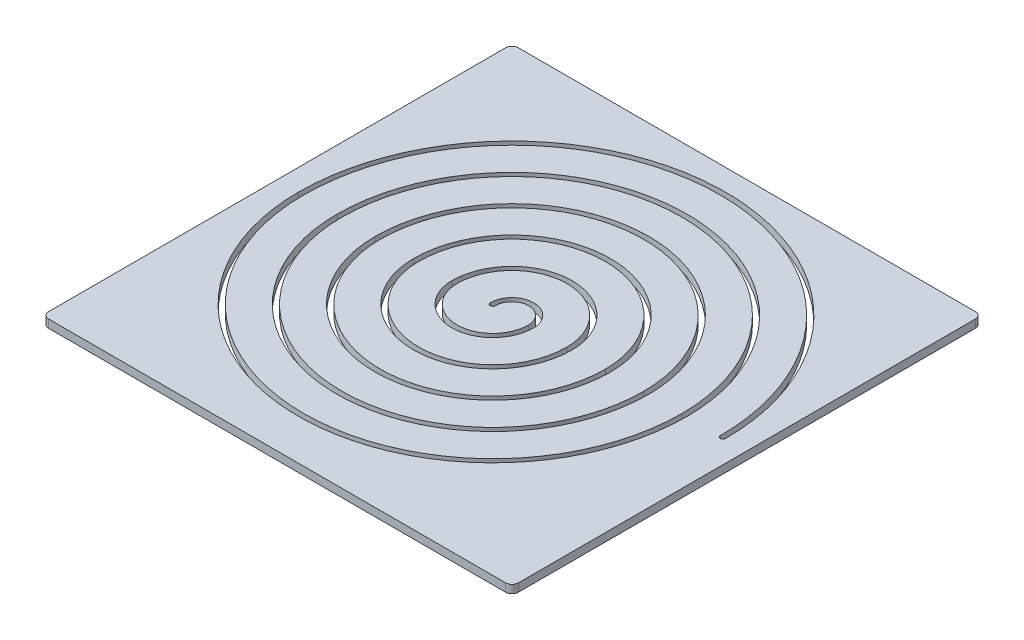
ISO-10303-21;
HEADER;
FILE_DESCRIPTION(('STEP AP214'),'2;1');
FILE_NAME('part.step','',(''),(''),'','','');
FILE_SCHEMA(('AUTOMOTIVE_DESIGN { 1 0 10303 214 1 1 1 1 }'));
ENDSEC;
DATA;
#1=APPLICATION_CONTEXT('core data for automotive mechanical design processes');
#2=APPLICATION_PROTOCOL_DEFINITION('international standard','automotive_design',2000,#1);
#3=PRODUCT_CONTEXT('',#1,'mechanical');
#4=PRODUCT('Part','Part','',(#3));
#5=PRODUCT_RELATED_PRODUCT_CATEGORY('part','',(#4));
#6=PRODUCT_DEFINITION_FORMATION('','',#4);
#7=PRODUCT_DEFINITION_CONTEXT('part definition',#1,'design');
#8=PRODUCT_DEFINITION('design','',#6,#7);
#9=PRODUCT_DEFINITION_SHAPE('','',#8);
#10=(LENGTH_UNIT() NAMED_UNIT(*) SI_UNIT(.MILLI.,.METRE.));
#11=(NAMED_UNIT(*) PLANE_ANGLE_UNIT() SI_UNIT($,.RADIAN.));
#12=(NAMED_UNIT(*) SI_UNIT($,.STERADIAN.) SOLID_ANGLE_UNIT());
#13=UNCERTAINTY_MEASURE_WITH_UNIT(LENGTH_MEASURE(1.E-05),#10,'distance_accuracy_value','');
#14=(GEOMETRIC_REPRESENTATION_CONTEXT(3) GLOBAL_UNCERTAINTY_ASSIGNED_CONTEXT((#13)) GLOBAL_UNIT_ASSIGNED_CONTEXT((#10,
#11,#12)) REPRESENTATION_CONTEXT('',''));
#15=CARTESIAN_POINT('',(0.,0.,0.));
#16=DIRECTION('',(0.,0.,1.));
#17=DIRECTION('',(1.,0.,0.));
#18=AXIS2_PLACEMENT_3D('',#15,#16,#17);
#19=CARTESIAN_POINT('',(-357.5,12.7,357.5));
#20=DIRECTION('',(0.,1.,0.));
#21=DIRECTION('',(0.,0.,1.));
#22=AXIS2_PLACEMENT_3D('',#19,#20,#21);
#23=PLANE('',#22);
#24=CARTESIAN_POINT('',(-357.5,12.7,357.5));
#25=DIRECTION('',(0.,1.,0.));
#26=DIRECTION('',(0.,0.,1.));
#27=AXIS2_PLACEMENT_3D('',#24,#25,#26);
#28=CIRCLE('',#27,9.99999999999998);
#29=CARTESIAN_POINT('',(-367.5,12.7,357.5));
#30=VERTEX_POINT('',#29);
#31=CARTESIAN_POINT('',(-357.5,12.7,367.5));
#32=VERTEX_POINT('',#31);
#33=EDGE_CURVE('E438',#30,#32,#28,.T.);
#34=ORIENTED_EDGE('',*,*,#33,.T.);
#35=DIRECTION('',(1.,0.,0.));
#36=VECTOR('',#35,1.);
#37=CARTESIAN_POINT('',(-357.5,12.7,367.5));
#38=LINE('',#37,#36);
#39=CARTESIAN_POINT('',(357.5,12.7,367.5));
#40=VERTEX_POINT('',#39);
#41=EDGE_CURVE('E441',#32,#40,#38,.T.);
#42=ORIENTED_EDGE('',*,*,#41,.T.);
#43=CARTESIAN_POINT('',(357.5,12.7,357.5));
#44=DIRECTION('',(0.,1.,0.));
#45=DIRECTION('',(0.,0.,1.));
#46=AXIS2_PLACEMENT_3D('',#43,#44,#45);
#47=CIRCLE('',#46,9.99999999999998);
#48=CARTESIAN_POINT('',(367.5,12.7,357.5));
#49=VERTEX_POINT('',#48);
#50=EDGE_CURVE('E444',#40,#49,#47,.T.);
#51=ORIENTED_EDGE('',*,*,#50,.T.);
#52=DIRECTION('',(0.,0.,-1.));
#53=VECTOR('',#52,1.);
#54=CARTESIAN_POINT('',(367.5,12.7,-357.5));
#55=LINE('',#54,#53);
#56=CARTESIAN_POINT('',(367.5,12.7,-357.5));
#57=VERTEX_POINT('',#56);
#58=EDGE_CURVE('E446',#49,#57,#55,.T.);
#59=ORIENTED_EDGE('',*,*,#58,.T.);
#60=CARTESIAN_POINT('',(357.5,12.7,-357.5));
#61=DIRECTION('',(0.,1.,0.));
#62=DIRECTION('',(0.,0.,-1.));
#63=AXIS2_PLACEMENT_3D('',#60,#61,#62);
#64=CIRCLE('',#63,9.99999999999998);
#65=CARTESIAN_POINT('',(357.5,12.7,-367.5));
#66=VERTEX_POINT('',#65);
#67=EDGE_CURVE('E448',#57,#66,#64,.T.);
#68=ORIENTED_EDGE('',*,*,#67,.T.);
#69=DIRECTION('',(-1.,0.,0.));
#70=VECTOR('',#69,1.);
#71=CARTESIAN_POINT('',(-357.5,12.7,-367.5));
#72=LINE('',#71,#70);
#73=CARTESIAN_POINT('',(-357.5,12.7,-367.5));
#74=VERTEX_POINT('',#73);
#75=EDGE_CURVE('E450',#66,#74,#72,.T.);
#76=ORIENTED_EDGE('',*,*,#75,.T.);
#77=CARTESIAN_POINT('',(-357.5,12.7,-357.5));
#78=DIRECTION('',(0.,1.,0.));
#79=DIRECTION('',(0.,0.,1.));
#80=AXIS2_PLACEMENT_3D('',#77,#78,#79);
#81=CIRCLE('',#80,9.99999999999998);
#82=CARTESIAN_POINT('',(-367.5,12.7,-357.5));
#83=VERTEX_POINT('',#82);
#84=EDGE_CURVE('E452',#74,#83,#81,.T.);
#85=ORIENTED_EDGE('',*,*,#84,.T.);
#86=DIRECTION('',(0.,0.,1.));
#87=VECTOR('',#86,1.);
#88=CARTESIAN_POINT('',(-367.5,12.7,-357.5));
#89=LINE('',#88,#87);
#90=EDGE_CURVE('E454',#83,#30,#89,.T.);
#91=ORIENTED_EDGE('',*,*,#90,.T.);
#92=EDGE_LOOP('',(#34,#42,#51,#59,#68,#76,#85,#91));
#93=FACE_BOUND('',#92,.T.);
#94=CARTESIAN_POINT('',(-30.,12.7,0.));
#95=DIRECTION('',(0.,-1.,0.));
#96=DIRECTION('',(0.,0.,-1.));
#97=AXIS2_PLACEMENT_3D('',#94,#95,#96);
#98=CIRCLE('',#97,56.);
#99=CARTESIAN_POINT('',(26.,12.7,0.));
#100=VERTEX_POINT('',#99);
#101=CARTESIAN_POINT('',(-86.,12.7,0.));
#102=VERTEX_POINT('',#101);
#103=EDGE_CURVE('E48',#100,#102,#98,.T.);
#104=ORIENTED_EDGE('',*,*,#103,.F.);
#105=CARTESIAN_POINT('',(0.,12.7,0.));
#106=DIRECTION('',(0.,-1.,0.));
#107=DIRECTION('',(0.,0.,1.));
#108=AXIS2_PLACEMENT_3D('',#105,#106,#107);
#109=CIRCLE('',#108,26.);
#110=CARTESIAN_POINT('',(-26.,12.7,0.));
#111=VERTEX_POINT('',#110);
#112=EDGE_CURVE('E260',#111,#100,#109,.T.);
#113=ORIENTED_EDGE('',*,*,#112,.F.);
#114=CARTESIAN_POINT('',(-30.,12.7,0.));
#115=DIRECTION('',(0.,1.,0.));
#116=DIRECTION('',(0.,0.,-1.));
#117=AXIS2_PLACEMENT_3D('',#114,#115,#116);
#118=CIRCLE('',#117,4.);
#119=CARTESIAN_POINT('',(-34.,12.7,0.));
#120=VERTEX_POINT('',#119);
#121=EDGE_CURVE('E263',#120,#111,#118,.T.);
#122=ORIENTED_EDGE('',*,*,#121,.F.);
#123=CARTESIAN_POINT('',(0.,12.7,0.));
#124=DIRECTION('',(0.,1.,0.));
#125=DIRECTION('',(0.,0.,1.));
#126=AXIS2_PLACEMENT_3D('',#123,#124,#125);
#127=CIRCLE('',#126,34.);
#128=CARTESIAN_POINT('',(34.,12.7,0.));
#129=VERTEX_POINT('',#128);
#130=EDGE_CURVE('E387',#129,#120,#127,.T.);
#131=ORIENTED_EDGE('',*,*,#130,.F.);
#132=CARTESIAN_POINT('',(-30.,12.7,0.));
#133=DIRECTION('',(0.,1.,0.));
#134=DIRECTION('',(0.,0.,-1.));
#135=AXIS2_PLACEMENT_3D('',#132,#133,#134);
#136=CIRCLE('',#135,64.);
#137=CARTESIAN_POINT('',(-94.,12.7,0.));
#138=VERTEX_POINT('',#137);
#139=EDGE_CURVE('E384',#138,#129,#136,.T.);
#140=ORIENTED_EDGE('',*,*,#139,.F.);
#141=CARTESIAN_POINT('',(0.,12.7,0.));
#142=DIRECTION('',(0.,1.,0.));
#143=DIRECTION('',(0.,0.,-1.));
#144=AXIS2_PLACEMENT_3D('',#141,#142,#143);
#145=CIRCLE('',#144,94.);
#146=CARTESIAN_POINT('',(94.,12.7,0.));
#147=VERTEX_POINT('',#146);
#148=EDGE_CURVE('E381',#147,#138,#145,.T.);
#149=ORIENTED_EDGE('',*,*,#148,.F.);
#150=CARTESIAN_POINT('',(-30.,12.7,0.));
#151=DIRECTION('',(0.,1.,0.));
#152=DIRECTION('',(0.,0.,-1.));
#153=AXIS2_PLACEMENT_3D('',#150,#151,#152);
#154=CIRCLE('',#153,124.);
#155=CARTESIAN_POINT('',(-154.,12.7,0.));
#156=VERTEX_POINT('',#155);
#157=EDGE_CURVE('E378',#156,#147,#154,.T.);
#158=ORIENTED_EDGE('',*,*,#157,.F.);
#159=CARTESIAN_POINT('',(0.,12.7,0.));
#160=DIRECTION('',(0.,1.,0.));
#161=DIRECTION('',(0.,0.,-1.));
#162=AXIS2_PLACEMENT_3D('',#159,#160,#161);
#163=CIRCLE('',#162,154.);
#164=CARTESIAN_POINT('',(154.,12.7,0.));
#165=VERTEX_POINT('',#164);
#166=EDGE_CURVE('E375',#165,#156,#163,.T.);
#167=ORIENTED_EDGE('',*,*,#166,.F.);
#168=CARTESIAN_POINT('',(-30.,12.7,0.));
#169=DIRECTION('',(0.,1.,0.));
#170=DIRECTION('',(0.,0.,-1.));
#171=AXIS2_PLACEMENT_3D('',#168,#169,#170);
#172=CIRCLE('',#171,184.);
#173=CARTESIAN_POINT('',(-214.,12.7,0.));
#174=VERTEX_POINT('',#173);
#175=EDGE_CURVE('E372',#174,#165,#172,.T.);
#176=ORIENTED_EDGE('',*,*,#175,.F.);
#177=CARTESIAN_POINT('',(0.,12.7,0.));
#178=DIRECTION('',(0.,1.,0.));
#179=DIRECTION('',(0.,0.,-1.));
#180=AXIS2_PLACEMENT_3D('',#177,#178,#179);
#181=CIRCLE('',#180,214.);
#182=CARTESIAN_POINT('',(214.,12.7,0.));
#183=VERTEX_POINT('',#182);
#184=EDGE_CURVE('E369',#183,#174,#181,.T.);
#185=ORIENTED_EDGE('',*,*,#184,.F.);
#186=CARTESIAN_POINT('',(-30.,12.7,0.));
#187=DIRECTION('',(0.,1.,0.));
#188=DIRECTION('',(0.,0.,-1.));
#189=AXIS2_PLACEMENT_3D('',#186,#187,#188);
#190=CIRCLE('',#189,244.);
#191=CARTESIAN_POINT('',(-274.,12.7,0.));
#192=VERTEX_POINT('',#191);
#193=EDGE_CURVE('E366',#192,#183,#190,.T.);
#194=ORIENTED_EDGE('',*,*,#193,.F.);
#195=CARTESIAN_POINT('',(0.,12.7,0.));
#196=DIRECTION('',(0.,1.,0.));
#197=DIRECTION('',(0.,0.,-1.));
#198=AXIS2_PLACEMENT_3D('',#195,#196,#197);
#199=CIRCLE('',#198,274.);
#200=CARTESIAN_POINT('',(274.,12.7,0.));
#201=VERTEX_POINT('',#200);
#202=EDGE_CURVE('E363',#201,#192,#199,.T.);
#203=ORIENTED_EDGE('',*,*,#202,.F.);
#204=CARTESIAN_POINT('',(-30.,12.7,0.));
#205=DIRECTION('',(0.,1.,0.));
#206=DIRECTION('',(0.,0.,-1.));
#207=AXIS2_PLACEMENT_3D('',#204,#205,#206);
#208=CIRCLE('',#207,304.);
#209=CARTESIAN_POINT('',(-334.,12.7,0.));
#210=VERTEX_POINT('',#209);
#211=EDGE_CURVE('E360',#210,#201,#208,.T.);
#212=ORIENTED_EDGE('',*,*,#211,.F.);
#213=CARTESIAN_POINT('',(0.,12.7,0.));
#214=DIRECTION('',(0.,1.,0.));
#215=DIRECTION('',(0.,0.,-1.));
#216=AXIS2_PLACEMENT_3D('',#213,#214,#215);
#217=CIRCLE('',#216,334.);
#218=CARTESIAN_POINT('',(334.,12.7,0.));
#219=VERTEX_POINT('',#218);
#220=EDGE_CURVE('E357',#219,#210,#217,.T.);
#221=ORIENTED_EDGE('',*,*,#220,.F.);
#222=CARTESIAN_POINT('',(330.,12.7,0.));
#223=DIRECTION('',(0.,1.,0.));
#224=DIRECTION('',(0.,0.,1.));
#225=AXIS2_PLACEMENT_3D('',#222,#223,#224);
#226=CIRCLE('',#225,4.);
#227=CARTESIAN_POINT('',(326.,12.7,0.));
#228=VERTEX_POINT('',#227);
#229=EDGE_CURVE('E354',#228,#219,#226,.T.);
#230=ORIENTED_EDGE('',*,*,#229,.F.);
#231=CARTESIAN_POINT('',(0.,12.7,0.));
#232=DIRECTION('',(0.,-1.,0.));
#233=DIRECTION('',(0.,0.,-1.));
#234=AXIS2_PLACEMENT_3D('',#231,#232,#233);
#235=CIRCLE('',#234,326.);
#236=CARTESIAN_POINT('',(-326.,12.7,0.));
#237=VERTEX_POINT('',#236);
#238=EDGE_CURVE('E351',#237,#228,#235,.T.);
#239=ORIENTED_EDGE('',*,*,#238,.F.);
#240=CARTESIAN_POINT('',(-30.,12.7,0.));
#241=DIRECTION('',(0.,-1.,0.));
#242=DIRECTION('',(0.,0.,-1.));
#243=AXIS2_PLACEMENT_3D('',#240,#241,#242);
#244=CIRCLE('',#243,296.);
#245=CARTESIAN_POINT('',(266.,12.7,0.));
#246=VERTEX_POINT('',#245);
#247=EDGE_CURVE('E348',#246,#237,#244,.T.);
#248=ORIENTED_EDGE('',*,*,#247,.F.);
#249=CARTESIAN_POINT('',(0.,12.7,0.));
#250=DIRECTION('',(0.,-1.,0.));
#251=DIRECTION('',(0.,0.,-1.));
#252=AXIS2_PLACEMENT_3D('',#249,#250,#251);
#253=CIRCLE('',#252,266.);
#254=CARTESIAN_POINT('',(-266.,12.7,0.));
#255=VERTEX_POINT('',#254);
#256=EDGE_CURVE('E345',#255,#246,#253,.T.);
#257=ORIENTED_EDGE('',*,*,#256,.F.);
#258=CARTESIAN_POINT('',(-30.,12.7,0.));
#259=DIRECTION('',(0.,-1.,0.));
#260=DIRECTION('',(0.,0.,-1.));
#261=AXIS2_PLACEMENT_3D('',#258,#259,#260);
#262=CIRCLE('',#261,236.);
#263=CARTESIAN_POINT('',(206.,12.7,0.));
#264=VERTEX_POINT('',#263);
#265=EDGE_CURVE('E342',#264,#255,#262,.T.);
#266=ORIENTED_EDGE('',*,*,#265,.F.);
#267=CARTESIAN_POINT('',(0.,12.7,0.));
#268=DIRECTION('',(0.,-1.,0.));
#269=DIRECTION('',(0.,0.,-1.));
#270=AXIS2_PLACEMENT_3D('',#267,#268,#269);
#271=CIRCLE('',#270,206.);
#272=CARTESIAN_POINT('',(-206.,12.7,0.));
#273=VERTEX_POINT('',#272);
#274=EDGE_CURVE('E339',#273,#264,#271,.T.);
#275=ORIENTED_EDGE('',*,*,#274,.F.);
#276=CARTESIAN_POINT('',(-30.,12.7,0.));
#277=DIRECTION('',(0.,-1.,0.));
#278=DIRECTION('',(0.,0.,-1.));
#279=AXIS2_PLACEMENT_3D('',#276,#277,#278);
#280=CIRCLE('',#279,176.);
#281=CARTESIAN_POINT('',(146.,12.7,0.));
#282=VERTEX_POINT('',#281);
#283=EDGE_CURVE('E336',#282,#273,#280,.T.);
#284=ORIENTED_EDGE('',*,*,#283,.F.);
#285=CARTESIAN_POINT('',(0.,12.7,0.));
#286=DIRECTION('',(0.,-1.,0.));
#287=DIRECTION('',(0.,0.,-1.));
#288=AXIS2_PLACEMENT_3D('',#285,#286,#287);
#289=CIRCLE('',#288,146.);
#290=CARTESIAN_POINT('',(-146.,12.7,0.));
#291=VERTEX_POINT('',#290);
#292=EDGE_CURVE('E333',#291,#282,#289,.T.);
#293=ORIENTED_EDGE('',*,*,#292,.F.);
#294=CARTESIAN_POINT('',(-30.,12.7,0.));
#295=DIRECTION('',(0.,-1.,0.));
#296=DIRECTION('',(0.,0.,-1.));
#297=AXIS2_PLACEMENT_3D('',#294,#295,#296);
#298=CIRCLE('',#297,116.);
#299=CARTESIAN_POINT('',(86.,12.7,0.));
#300=VERTEX_POINT('',#299);
#301=EDGE_CURVE('E330',#300,#291,#298,.T.);
#302=ORIENTED_EDGE('',*,*,#301,.F.);
#303=CARTESIAN_POINT('',(0.,12.7,0.));
#304=DIRECTION('',(0.,-1.,0.));
#305=DIRECTION('',(0.,0.,-1.));
#306=AXIS2_PLACEMENT_3D('',#303,#304,#305);
#307=CIRCLE('',#306,86.);
#308=EDGE_CURVE('E328',#102,#300,#307,.T.);
#309=ORIENTED_EDGE('',*,*,#308,.F.);
#310=EDGE_LOOP('',(#104,#113,#122,#131,#140,#149,#158,#167,#176,#185,#194,#203,#212,#221,#230,
#239,#248,#257,#266,#275,#284,#293,#302,#309));
#311=FACE_BOUND('',#310,.T.);
#312=ADVANCED_FACE('F33',(#93,#311),#23,.T.);
#313=CARTESIAN_POINT('',(-357.5,0.,357.5));
#314=DIRECTION('',(0.,1.,0.));
#315=DIRECTION('',(0.,0.,1.));
#316=AXIS2_PLACEMENT_3D('',#313,#314,#315);
#317=PLANE('',#316);
#318=CARTESIAN_POINT('',(-357.5,0.,357.5));
#319=DIRECTION('',(0.,1.,0.));
#320=DIRECTION('',(0.,0.,1.));
#321=AXIS2_PLACEMENT_3D('',#318,#319,#320);
#322=CIRCLE('',#321,9.99999999999998);
#323=CARTESIAN_POINT('',(-367.5,0.,357.5));
#324=VERTEX_POINT('',#323);
#325=CARTESIAN_POINT('',(-357.5,0.,367.5));
#326=VERTEX_POINT('',#325);
#327=EDGE_CURVE('E394',#324,#326,#322,.T.);
#328=ORIENTED_EDGE('',*,*,#327,.F.);
#329=DIRECTION('',(0.,0.,1.));
#330=VECTOR('',#329,1.);
#331=CARTESIAN_POINT('',(-367.5,0.,-357.5));
#332=LINE('',#331,#330);
#333=CARTESIAN_POINT('',(-367.5,0.,-357.5));
#334=VERTEX_POINT('',#333);
#335=EDGE_CURVE('E442',#334,#324,#332,.T.);
#336=ORIENTED_EDGE('',*,*,#335,.F.);
#337=CARTESIAN_POINT('',(-357.5,0.,-357.5));
#338=DIRECTION('',(0.,1.,0.));
#339=DIRECTION('',(0.,0.,1.));
#340=AXIS2_PLACEMENT_3D('',#337,#338,#339);
#341=CIRCLE('',#340,9.99999999999998);
#342=CARTESIAN_POINT('',(-357.5,0.,-367.5));
#343=VERTEX_POINT('',#342);
#344=EDGE_CURVE('E469',#343,#334,#341,.T.);
#345=ORIENTED_EDGE('',*,*,#344,.F.);
#346=DIRECTION('',(-1.,0.,0.));
#347=VECTOR('',#346,1.);
#348=CARTESIAN_POINT('',(-357.5,0.,-367.5));
#349=LINE('',#348,#347);
#350=CARTESIAN_POINT('',(357.5,0.,-367.5));
#351=VERTEX_POINT('',#350);
#352=EDGE_CURVE('E467',#351,#343,#349,.T.);
#353=ORIENTED_EDGE('',*,*,#352,.F.);
#354=CARTESIAN_POINT('',(357.5,0.,-357.5));
#355=DIRECTION('',(0.,1.,0.));
#356=DIRECTION('',(0.,0.,-1.));
#357=AXIS2_PLACEMENT_3D('',#354,#355,#356);
#358=CIRCLE('',#357,9.99999999999998);
#359=CARTESIAN_POINT('',(367.5,0.,-357.5));
#360=VERTEX_POINT('',#359);
#361=EDGE_CURVE('E465',#360,#351,#358,.T.);
#362=ORIENTED_EDGE('',*,*,#361,.F.);
#363=DIRECTION('',(0.,0.,-1.));
#364=VECTOR('',#363,1.);
#365=CARTESIAN_POINT('',(367.5,0.,-357.5));
#366=LINE('',#365,#364);
#367=CARTESIAN_POINT('',(367.5,0.,357.5));
#368=VERTEX_POINT('',#367);
#369=EDGE_CURVE('E463',#368,#360,#366,.T.);
#370=ORIENTED_EDGE('',*,*,#369,.F.);
#371=CARTESIAN_POINT('',(357.5,0.,357.5));
#372=DIRECTION('',(0.,1.,0.));
#373=DIRECTION('',(0.,0.,1.));
#374=AXIS2_PLACEMENT_3D('',#371,#372,#373);
#375=CIRCLE('',#374,9.99999999999998);
#376=CARTESIAN_POINT('',(357.5,0.,367.5));
#377=VERTEX_POINT('',#376);
#378=EDGE_CURVE('E461',#377,#368,#375,.T.);
#379=ORIENTED_EDGE('',*,*,#378,.F.);
#380=DIRECTION('',(1.,0.,0.));
#381=VECTOR('',#380,1.);
#382=CARTESIAN_POINT('',(-357.5,0.,367.5));
#383=LINE('',#382,#381);
#384=EDGE_CURVE('E459',#326,#377,#383,.T.);
#385=ORIENTED_EDGE('',*,*,#384,.F.);
#386=EDGE_LOOP('',(#328,#336,#345,#353,#362,#370,#379,#385));
#387=FACE_BOUND('',#386,.T.);
#388=CARTESIAN_POINT('',(0.,0.,0.));
#389=DIRECTION('',(0.,-1.,0.));
#390=DIRECTION('',(0.,0.,1.));
#391=AXIS2_PLACEMENT_3D('',#388,#389,#390);
#392=CIRCLE('',#391,26.);
#393=CARTESIAN_POINT('',(-26.,0.,0.));
#394=VERTEX_POINT('',#393);
#395=CARTESIAN_POINT('',(26.,0.,0.));
#396=VERTEX_POINT('',#395);
#397=EDGE_CURVE('E250',#394,#396,#392,.T.);
#398=ORIENTED_EDGE('',*,*,#397,.T.);
#399=CARTESIAN_POINT('',(-30.,0.,0.));
#400=DIRECTION('',(0.,-1.,0.));
#401=DIRECTION('',(0.,0.,-1.));
#402=AXIS2_PLACEMENT_3D('',#399,#400,#401);
#403=CIRCLE('',#402,56.);
#404=CARTESIAN_POINT('',(-86.,0.,0.));
#405=VERTEX_POINT('',#404);
#406=EDGE_CURVE('E244',#396,#405,#403,.T.);
#407=ORIENTED_EDGE('',*,*,#406,.T.);
#408=CARTESIAN_POINT('',(0.,0.,0.));
#409=DIRECTION('',(0.,-1.,0.));
#410=DIRECTION('',(0.,0.,-1.));
#411=AXIS2_PLACEMENT_3D('',#408,#409,#410);
#412=CIRCLE('',#411,86.);
#413=CARTESIAN_POINT('',(86.,0.,0.));
#414=VERTEX_POINT('',#413);
#415=EDGE_CURVE('E253',#405,#414,#412,.T.);
#416=ORIENTED_EDGE('',*,*,#415,.T.);
#417=CARTESIAN_POINT('',(-30.,0.,0.));
#418=DIRECTION('',(0.,-1.,0.));
#419=DIRECTION('',(0.,0.,-1.));
#420=AXIS2_PLACEMENT_3D('',#417,#418,#419);
#421=CIRCLE('',#420,116.);
#422=CARTESIAN_POINT('',(-146.,0.,0.));
#423=VERTEX_POINT('',#422);
#424=EDGE_CURVE('E56',#414,#423,#421,.T.);
#425=ORIENTED_EDGE('',*,*,#424,.T.);
#426=CARTESIAN_POINT('',(0.,0.,0.));
#427=DIRECTION('',(0.,-1.,0.));
#428=DIRECTION('',(0.,0.,-1.));
#429=AXIS2_PLACEMENT_3D('',#426,#427,#428);
#430=CIRCLE('',#429,146.);
#431=CARTESIAN_POINT('',(146.,0.,0.));
#432=VERTEX_POINT('',#431);
#433=EDGE_CURVE('E267',#423,#432,#430,.T.);
#434=ORIENTED_EDGE('',*,*,#433,.T.);
#435=CARTESIAN_POINT('',(-30.,0.,0.));
#436=DIRECTION('',(0.,-1.,0.));
#437=DIRECTION('',(0.,0.,-1.));
#438=AXIS2_PLACEMENT_3D('',#435,#436,#437);
#439=CIRCLE('',#438,176.);
#440=CARTESIAN_POINT('',(-206.,0.,0.));
#441=VERTEX_POINT('',#440);
#442=EDGE_CURVE('E270',#432,#441,#439,.T.);
#443=ORIENTED_EDGE('',*,*,#442,.T.);
#444=CARTESIAN_POINT('',(0.,0.,0.));
#445=DIRECTION('',(0.,-1.,0.));
#446=DIRECTION('',(0.,0.,-1.));
#447=AXIS2_PLACEMENT_3D('',#444,#445,#446);
#448=CIRCLE('',#447,206.);
#449=CARTESIAN_POINT('',(206.,0.,0.));
#450=VERTEX_POINT('',#449);
#451=EDGE_CURVE('E273',#441,#450,#448,.T.);
#452=ORIENTED_EDGE('',*,*,#451,.T.);
#453=CARTESIAN_POINT('',(-30.,0.,0.));
#454=DIRECTION('',(0.,-1.,0.));
#455=DIRECTION('',(0.,0.,-1.));
#456=AXIS2_PLACEMENT_3D('',#453,#454,#455);
#457=CIRCLE('',#456,236.);
#458=CARTESIAN_POINT('',(-266.,0.,0.));
#459=VERTEX_POINT('',#458);
#460=EDGE_CURVE('E276',#450,#459,#457,.T.);
#461=ORIENTED_EDGE('',*,*,#460,.T.);
#462=CARTESIAN_POINT('',(0.,0.,0.));
#463=DIRECTION('',(0.,-1.,0.));
#464=DIRECTION('',(0.,0.,-1.));
#465=AXIS2_PLACEMENT_3D('',#462,#463,#464);
#466=CIRCLE('',#465,266.);
#467=CARTESIAN_POINT('',(266.,0.,0.));
#468=VERTEX_POINT('',#467);
#469=EDGE_CURVE('E279',#459,#468,#466,.T.);
#470=ORIENTED_EDGE('',*,*,#469,.T.);
#471=CARTESIAN_POINT('',(-30.,0.,0.));
#472=DIRECTION('',(0.,-1.,0.));
#473=DIRECTION('',(0.,0.,-1.));
#474=AXIS2_PLACEMENT_3D('',#471,#472,#473);
#475=CIRCLE('',#474,296.);
#476=CARTESIAN_POINT('',(-326.,0.,0.));
#477=VERTEX_POINT('',#476);
#478=EDGE_CURVE('E282',#468,#477,#475,.T.);
#479=ORIENTED_EDGE('',*,*,#478,.T.);
#480=CARTESIAN_POINT('',(0.,0.,0.));
#481=DIRECTION('',(0.,-1.,0.));
#482=DIRECTION('',(0.,0.,-1.));
#483=AXIS2_PLACEMENT_3D('',#480,#481,#482);
#484=CIRCLE('',#483,326.);
#485=CARTESIAN_POINT('',(326.,0.,0.));
#486=VERTEX_POINT('',#485);
#487=EDGE_CURVE('E285',#477,#486,#484,.T.);
#488=ORIENTED_EDGE('',*,*,#487,.T.);
#489=CARTESIAN_POINT('',(330.,0.,0.));
#490=DIRECTION('',(0.,1.,0.));
#491=DIRECTION('',(0.,0.,1.));
#492=AXIS2_PLACEMENT_3D('',#489,#490,#491);
#493=CIRCLE('',#492,4.);
#494=CARTESIAN_POINT('',(334.,0.,0.));
#495=VERTEX_POINT('',#494);
#496=EDGE_CURVE('E288',#486,#495,#493,.T.);
#497=ORIENTED_EDGE('',*,*,#496,.T.);
#498=CARTESIAN_POINT('',(0.,0.,0.));
#499=DIRECTION('',(0.,1.,0.));
#500=DIRECTION('',(0.,0.,-1.));
#501=AXIS2_PLACEMENT_3D('',#498,#499,#500);
#502=CIRCLE('',#501,334.);
#503=CARTESIAN_POINT('',(-334.,0.,0.));
#504=VERTEX_POINT('',#503);
#505=EDGE_CURVE('E291',#495,#504,#502,.T.);
#506=ORIENTED_EDGE('',*,*,#505,.T.);
#507=CARTESIAN_POINT('',(-30.,0.,0.));
#508=DIRECTION('',(0.,1.,0.));
#509=DIRECTION('',(0.,0.,-1.));
#510=AXIS2_PLACEMENT_3D('',#507,#508,#509);
#511=CIRCLE('',#510,304.);
#512=CARTESIAN_POINT('',(274.,0.,0.));
#513=VERTEX_POINT('',#512);
#514=EDGE_CURVE('E294',#504,#513,#511,.T.);
#515=ORIENTED_EDGE('',*,*,#514,.T.);
#516=CARTESIAN_POINT('',(0.,0.,0.));
#517=DIRECTION('',(0.,1.,0.));
#518=DIRECTION('',(0.,0.,-1.));
#519=AXIS2_PLACEMENT_3D('',#516,#517,#518);
#520=CIRCLE('',#519,274.);
#521=CARTESIAN_POINT('',(-274.,0.,0.));
#522=VERTEX_POINT('',#521);
#523=EDGE_CURVE('E297',#513,#522,#520,.T.);
#524=ORIENTED_EDGE('',*,*,#523,.T.);
#525=CARTESIAN_POINT('',(-30.,0.,0.));
#526=DIRECTION('',(0.,1.,0.));
#527=DIRECTION('',(0.,0.,-1.));
#528=AXIS2_PLACEMENT_3D('',#525,#526,#527);
#529=CIRCLE('',#528,244.);
#530=CARTESIAN_POINT('',(214.,0.,0.));
#531=VERTEX_POINT('',#530);
#532=EDGE_CURVE('E300',#522,#531,#529,.T.);
#533=ORIENTED_EDGE('',*,*,#532,.T.);
#534=CARTESIAN_POINT('',(0.,0.,0.));
#535=DIRECTION('',(0.,1.,0.));
#536=DIRECTION('',(0.,0.,-1.));
#537=AXIS2_PLACEMENT_3D('',#534,#535,#536);
#538=CIRCLE('',#537,214.);
#539=CARTESIAN_POINT('',(-214.,0.,0.));
#540=VERTEX_POINT('',#539);
#541=EDGE_CURVE('E303',#531,#540,#538,.T.);
#542=ORIENTED_EDGE('',*,*,#541,.T.);
#543=CARTESIAN_POINT('',(-30.,0.,0.));
#544=DIRECTION('',(0.,1.,0.));
#545=DIRECTION('',(0.,0.,-1.));
#546=AXIS2_PLACEMENT_3D('',#543,#544,#545);
#547=CIRCLE('',#546,184.);
#548=CARTESIAN_POINT('',(154.,0.,0.));
#549=VERTEX_POINT('',#548);
#550=EDGE_CURVE('E306',#540,#549,#547,.T.);
#551=ORIENTED_EDGE('',*,*,#550,.T.);
#552=CARTESIAN_POINT('',(0.,0.,0.));
#553=DIRECTION('',(0.,1.,0.));
#554=DIRECTION('',(0.,0.,-1.));
#555=AXIS2_PLACEMENT_3D('',#552,#553,#554);
#556=CIRCLE('',#555,154.);
#557=CARTESIAN_POINT('',(-154.,0.,0.));
#558=VERTEX_POINT('',#557);
#559=EDGE_CURVE('E309',#549,#558,#556,.T.);
#560=ORIENTED_EDGE('',*,*,#559,.T.);
#561=CARTESIAN_POINT('',(-30.,0.,0.));
#562=DIRECTION('',(0.,1.,0.));
#563=DIRECTION('',(0.,0.,-1.));
#564=AXIS2_PLACEMENT_3D('',#561,#562,#563);
#565=CIRCLE('',#564,124.);
#566=CARTESIAN_POINT('',(94.,0.,0.));
#567=VERTEX_POINT('',#566);
#568=EDGE_CURVE('E312',#558,#567,#565,.T.);
#569=ORIENTED_EDGE('',*,*,#568,.T.);
#570=CARTESIAN_POINT('',(0.,0.,0.));
#571=DIRECTION('',(0.,1.,0.));
#572=DIRECTION('',(0.,0.,-1.));
#573=AXIS2_PLACEMENT_3D('',#570,#571,#572);
#574=CIRCLE('',#573,94.);
#575=CARTESIAN_POINT('',(-94.,0.,0.));
#576=VERTEX_POINT('',#575);
#577=EDGE_CURVE('E315',#567,#576,#574,.T.);
#578=ORIENTED_EDGE('',*,*,#577,.T.);
#579=CARTESIAN_POINT('',(-30.,0.,0.));
#580=DIRECTION('',(0.,1.,0.));
#581=DIRECTION('',(0.,0.,-1.));
#582=AXIS2_PLACEMENT_3D('',#579,#580,#581);
#583=CIRCLE('',#582,64.);
#584=CARTESIAN_POINT('',(34.,0.,0.));
#585=VERTEX_POINT('',#584);
#586=EDGE_CURVE('E318',#576,#585,#583,.T.);
#587=ORIENTED_EDGE('',*,*,#586,.T.);
#588=CARTESIAN_POINT('',(0.,0.,0.));
#589=DIRECTION('',(0.,1.,0.));
#590=DIRECTION('',(0.,0.,1.));
#591=AXIS2_PLACEMENT_3D('',#588,#589,#590);
#592=CIRCLE('',#591,34.);
#593=CARTESIAN_POINT('',(-34.,0.,0.));
#594=VERTEX_POINT('',#593);
#595=EDGE_CURVE('E321',#585,#594,#592,.T.);
#596=ORIENTED_EDGE('',*,*,#595,.T.);
#597=CARTESIAN_POINT('',(-30.,0.,0.));
#598=DIRECTION('',(0.,1.,0.));
#599=DIRECTION('',(0.,0.,-1.));
#600=AXIS2_PLACEMENT_3D('',#597,#598,#599);
#601=CIRCLE('',#600,4.);
#602=EDGE_CURVE('E324',#594,#394,#601,.T.);
#603=ORIENTED_EDGE('',*,*,#602,.T.);
#604=EDGE_LOOP('',(#398,#407,#416,#425,#434,#443,#452,#461,#470,#479,#488,#497,#506,#515,#524,
#533,#542,#551,#560,#569,#578,#587,#596,#603));
#605=FACE_BOUND('',#604,.T.);
#606=ADVANCED_FACE('F257',(#387,#605),#317,.F.);
#607=CARTESIAN_POINT('',(-357.5,12.7,357.5));
#608=DIRECTION('',(0.,-1.,0.));
#609=DIRECTION('',(0.,0.,-1.));
#610=AXIS2_PLACEMENT_3D('',#607,#608,#609);
#611=CYLINDRICAL_SURFACE('',#610,9.99999999999998);
#612=ORIENTED_EDGE('',*,*,#327,.T.);
#613=DIRECTION('',(0.,-1.,0.));
#614=VECTOR('',#613,1.);
#615=CARTESIAN_POINT('',(-357.5,12.7,367.5));
#616=LINE('',#615,#614);
#617=EDGE_CURVE('E11',#32,#326,#616,.T.);
#618=ORIENTED_EDGE('',*,*,#617,.F.);
#619=ORIENTED_EDGE('',*,*,#33,.F.);
#620=DIRECTION('',(0.,-1.,0.));
#621=VECTOR('',#620,1.);
#622=CARTESIAN_POINT('',(-367.5,12.7,357.5));
#623=LINE('',#622,#621);
#624=EDGE_CURVE('E456',#30,#324,#623,.T.);
#625=ORIENTED_EDGE('',*,*,#624,.T.);
#626=EDGE_LOOP('',(#612,#618,#619,#625));
#627=FACE_BOUND('',#626,.T.);
#628=ADVANCED_FACE('F35',(#627),#611,.T.);
#629=CARTESIAN_POINT('',(-357.5,12.7,367.5));
#630=DIRECTION('',(0.,0.,-1.));
#631=DIRECTION('',(-1.,0.,0.));
#632=AXIS2_PLACEMENT_3D('',#629,#630,#631);
#633=PLANE('',#632);
#634=ORIENTED_EDGE('',*,*,#384,.T.);
#635=DIRECTION('',(0.,-1.,0.));
#636=VECTOR('',#635,1.);
#637=CARTESIAN_POINT('',(357.5,12.7,367.5));
#638=LINE('',#637,#636);
#639=EDGE_CURVE('E41',#40,#377,#638,.T.);
#640=ORIENTED_EDGE('',*,*,#639,.F.);
#641=ORIENTED_EDGE('',*,*,#41,.F.);
#642=ORIENTED_EDGE('',*,*,#617,.T.);
#643=EDGE_LOOP('',(#634,#640,#641,#642));
#644=FACE_BOUND('',#643,.T.);
#645=ADVANCED_FACE('F515',(#644),#633,.F.);
#646=CARTESIAN_POINT('',(357.5,12.7,357.5));
#647=DIRECTION('',(0.,-1.,0.));
#648=DIRECTION('',(0.,0.,-1.));
#649=AXIS2_PLACEMENT_3D('',#646,#647,#648);
#650=CYLINDRICAL_SURFACE('',#649,9.99999999999998);
#651=ORIENTED_EDGE('',*,*,#378,.T.);
#652=DIRECTION('',(0.,-1.,0.));
#653=VECTOR('',#652,1.);
#654=CARTESIAN_POINT('',(367.5,12.7,357.5));
#655=LINE('',#654,#653);
#656=EDGE_CURVE('E486',#49,#368,#655,.T.);
#657=ORIENTED_EDGE('',*,*,#656,.F.);
#658=ORIENTED_EDGE('',*,*,#50,.F.);
#659=ORIENTED_EDGE('',*,*,#639,.T.);
#660=EDGE_LOOP('',(#651,#657,#658,#659));
#661=FACE_BOUND('',#660,.T.);
#662=ADVANCED_FACE('F493',(#661),#650,.T.);
#663=CARTESIAN_POINT('',(367.5,12.7,-357.5));
#664=DIRECTION('',(-1.,0.,0.));
#665=DIRECTION('',(0.,0.,1.));
#666=AXIS2_PLACEMENT_3D('',#663,#664,#665);
#667=PLANE('',#666);
#668=ORIENTED_EDGE('',*,*,#369,.T.);
#669=DIRECTION('',(0.,-1.,0.));
#670=VECTOR('',#669,1.);
#671=CARTESIAN_POINT('',(367.5,12.7,-357.5));
#672=LINE('',#671,#670);
#673=EDGE_CURVE('E483',#57,#360,#672,.T.);
#674=ORIENTED_EDGE('',*,*,#673,.F.);
#675=ORIENTED_EDGE('',*,*,#58,.F.);
#676=ORIENTED_EDGE('',*,*,#656,.T.);
#677=EDGE_LOOP('',(#668,#674,#675,#676));
#678=FACE_BOUND('',#677,.T.);
#679=ADVANCED_FACE('F503',(#678),#667,.F.);
#680=CARTESIAN_POINT('',(357.5,12.7,-357.5));
#681=DIRECTION('',(0.,-1.,0.));
#682=DIRECTION('',(0.,0.,-1.));
#683=AXIS2_PLACEMENT_3D('',#680,#681,#682);
#684=CYLINDRICAL_SURFACE('',#683,9.99999999999998);
#685=ORIENTED_EDGE('',*,*,#361,.T.);
#686=DIRECTION('',(0.,-1.,0.));
#687=VECTOR('',#686,1.);
#688=CARTESIAN_POINT('',(357.5,12.7,-367.5));
#689=LINE('',#688,#687);
#690=EDGE_CURVE('E480',#66,#351,#689,.T.);
#691=ORIENTED_EDGE('',*,*,#690,.F.);
#692=ORIENTED_EDGE('',*,*,#67,.F.);
#693=ORIENTED_EDGE('',*,*,#673,.T.);
#694=EDGE_LOOP('',(#685,#691,#692,#693));
#695=FACE_BOUND('',#694,.T.);
#696=ADVANCED_FACE('F507',(#695),#684,.T.);
#697=CARTESIAN_POINT('',(-357.5,12.7,-367.5));
#698=DIRECTION('',(0.,0.,1.));
#699=DIRECTION('',(1.,0.,0.));
#700=AXIS2_PLACEMENT_3D('',#697,#698,#699);
#701=PLANE('',#700);
#702=ORIENTED_EDGE('',*,*,#352,.T.);
#703=DIRECTION('',(0.,-1.,0.));
#704=VECTOR('',#703,1.);
#705=CARTESIAN_POINT('',(-357.5,12.7,-367.5));
#706=LINE('',#705,#704);
#707=EDGE_CURVE('E477',#74,#343,#706,.T.);
#708=ORIENTED_EDGE('',*,*,#707,.F.);
#709=ORIENTED_EDGE('',*,*,#75,.F.);
#710=ORIENTED_EDGE('',*,*,#690,.T.);
#711=EDGE_LOOP('',(#702,#708,#709,#710));
#712=FACE_BOUND('',#711,.T.);
#713=ADVANCED_FACE('F528',(#712),#701,.F.);
#714=CARTESIAN_POINT('',(-357.5,12.7,-357.5));
#715=DIRECTION('',(0.,-1.,0.));
#716=DIRECTION('',(0.,0.,-1.));
#717=AXIS2_PLACEMENT_3D('',#714,#715,#716);
#718=CYLINDRICAL_SURFACE('',#717,9.99999999999998);
#719=ORIENTED_EDGE('',*,*,#344,.T.);
#720=DIRECTION('',(0.,-1.,0.));
#721=VECTOR('',#720,1.);
#722=CARTESIAN_POINT('',(-367.5,12.7,-357.5));
#723=LINE('',#722,#721);
#724=EDGE_CURVE('E474',#83,#334,#723,.T.);
#725=ORIENTED_EDGE('',*,*,#724,.F.);
#726=ORIENTED_EDGE('',*,*,#84,.F.);
#727=ORIENTED_EDGE('',*,*,#707,.T.);
#728=EDGE_LOOP('',(#719,#725,#726,#727));
#729=FACE_BOUND('',#728,.T.);
#730=ADVANCED_FACE('F526',(#729),#718,.T.);
#731=CARTESIAN_POINT('',(-367.5,12.7,-357.5));
#732=DIRECTION('',(1.,0.,0.));
#733=DIRECTION('',(0.,0.,-1.));
#734=AXIS2_PLACEMENT_3D('',#731,#732,#733);
#735=PLANE('',#734);
#736=ORIENTED_EDGE('',*,*,#335,.T.);
#737=ORIENTED_EDGE('',*,*,#624,.F.);
#738=ORIENTED_EDGE('',*,*,#90,.F.);
#739=ORIENTED_EDGE('',*,*,#724,.T.);
#740=EDGE_LOOP('',(#736,#737,#738,#739));
#741=FACE_BOUND('',#740,.T.);
#742=ADVANCED_FACE('F521',(#741),#735,.F.);
#743=CARTESIAN_POINT('',(-30.,0.,0.));
#744=DIRECTION('',(0.,1.,0.));
#745=DIRECTION('',(0.,0.,1.));
#746=AXIS2_PLACEMENT_3D('',#743,#744,#745);
#747=CYLINDRICAL_SURFACE('',#746,56.);
#748=ORIENTED_EDGE('',*,*,#103,.T.);
#749=DIRECTION('',(0.,1.,0.));
#750=VECTOR('',#749,1.);
#751=CARTESIAN_POINT('',(-86.,0.,0.));
#752=LINE('',#751,#750);
#753=EDGE_CURVE('E240',#405,#102,#752,.T.);
#754=ORIENTED_EDGE('',*,*,#753,.F.);
#755=ORIENTED_EDGE('',*,*,#406,.F.);
#756=DIRECTION('',(0.,1.,0.));
#757=VECTOR('',#756,1.);
#758=CARTESIAN_POINT('',(26.,0.,0.));
#759=LINE('',#758,#757);
#760=EDGE_CURVE('E392',#396,#100,#759,.T.);
#761=ORIENTED_EDGE('',*,*,#760,.T.);
#762=EDGE_LOOP('',(#748,#754,#755,#761));
#763=FACE_BOUND('',#762,.T.);
#764=ADVANCED_FACE('F242',(#763),#747,.T.);
#765=CARTESIAN_POINT('',(0.,0.,0.));
#766=DIRECTION('',(0.,1.,0.));
#767=DIRECTION('',(0.,0.,1.));
#768=AXIS2_PLACEMENT_3D('',#765,#766,#767);
#769=CYLINDRICAL_SURFACE('',#768,26.);
#770=ORIENTED_EDGE('',*,*,#112,.T.);
#771=ORIENTED_EDGE('',*,*,#760,.F.);
#772=ORIENTED_EDGE('',*,*,#397,.F.);
#773=DIRECTION('',(0.,1.,0.));
#774=VECTOR('',#773,1.);
#775=CARTESIAN_POINT('',(-26.,0.,0.));
#776=LINE('',#775,#774);
#777=EDGE_CURVE('E395',#394,#111,#776,.T.);
#778=ORIENTED_EDGE('',*,*,#777,.T.);
#779=EDGE_LOOP('',(#770,#771,#772,#778));
#780=FACE_BOUND('',#779,.T.);
#781=ADVANCED_FACE('F550',(#780),#769,.T.);
#782=CARTESIAN_POINT('',(-30.,0.,0.));
#783=DIRECTION('',(0.,1.,0.));
#784=DIRECTION('',(0.,0.,1.));
#785=AXIS2_PLACEMENT_3D('',#782,#783,#784);
#786=CYLINDRICAL_SURFACE('',#785,4.);
#787=ORIENTED_EDGE('',*,*,#121,.T.);
#788=ORIENTED_EDGE('',*,*,#777,.F.);
#789=ORIENTED_EDGE('',*,*,#602,.F.);
#790=DIRECTION('',(0.,1.,0.));
#791=VECTOR('',#790,1.);
#792=CARTESIAN_POINT('',(-34.,0.,0.));
#793=LINE('',#792,#791);
#794=EDGE_CURVE('E397',#594,#120,#793,.T.);
#795=ORIENTED_EDGE('',*,*,#794,.T.);
#796=EDGE_LOOP('',(#787,#788,#789,#795));
#797=FACE_BOUND('',#796,.T.);
#798=ADVANCED_FACE('F554',(#797),#786,.F.);
#799=CARTESIAN_POINT('',(0.,0.,0.));
#800=DIRECTION('',(0.,1.,0.));
#801=DIRECTION('',(0.,0.,1.));
#802=AXIS2_PLACEMENT_3D('',#799,#800,#801);
#803=CYLINDRICAL_SURFACE('',#802,34.);
#804=ORIENTED_EDGE('',*,*,#130,.T.);
#805=ORIENTED_EDGE('',*,*,#794,.F.);
#806=ORIENTED_EDGE('',*,*,#595,.F.);
#807=DIRECTION('',(0.,1.,0.));
#808=VECTOR('',#807,1.);
#809=CARTESIAN_POINT('',(34.,0.,0.));
#810=LINE('',#809,#808);
#811=EDGE_CURVE('E399',#585,#129,#810,.T.);
#812=ORIENTED_EDGE('',*,*,#811,.T.);
#813=EDGE_LOOP('',(#804,#805,#806,#812));
#814=FACE_BOUND('',#813,.T.);
#815=ADVANCED_FACE('F560',(#814),#803,.F.);
#816=CARTESIAN_POINT('',(-30.,0.,0.));
#817=DIRECTION('',(0.,1.,0.));
#818=DIRECTION('',(0.,0.,1.));
#819=AXIS2_PLACEMENT_3D('',#816,#817,#818);
#820=CYLINDRICAL_SURFACE('',#819,64.);
#821=ORIENTED_EDGE('',*,*,#139,.T.);
#822=ORIENTED_EDGE('',*,*,#811,.F.);
#823=ORIENTED_EDGE('',*,*,#586,.F.);
#824=DIRECTION('',(0.,1.,0.));
#825=VECTOR('',#824,1.);
#826=CARTESIAN_POINT('',(-94.,0.,0.));
#827=LINE('',#826,#825);
#828=EDGE_CURVE('E401',#576,#138,#827,.T.);
#829=ORIENTED_EDGE('',*,*,#828,.T.);
#830=EDGE_LOOP('',(#821,#822,#823,#829));
#831=FACE_BOUND('',#830,.T.);
#832=ADVANCED_FACE('F566',(#831),#820,.F.);
#833=CARTESIAN_POINT('',(0.,0.,0.));
#834=DIRECTION('',(0.,1.,0.));
#835=DIRECTION('',(0.,0.,1.));
#836=AXIS2_PLACEMENT_3D('',#833,#834,#835);
#837=CYLINDRICAL_SURFACE('',#836,94.);
#838=ORIENTED_EDGE('',*,*,#148,.T.);
#839=ORIENTED_EDGE('',*,*,#828,.F.);
#840=ORIENTED_EDGE('',*,*,#577,.F.);
#841=DIRECTION('',(0.,1.,0.));
#842=VECTOR('',#841,1.);
#843=CARTESIAN_POINT('',(94.,0.,0.));
#844=LINE('',#843,#842);
#845=EDGE_CURVE('E403',#567,#147,#844,.T.);
#846=ORIENTED_EDGE('',*,*,#845,.T.);
#847=EDGE_LOOP('',(#838,#839,#840,#846));
#848=FACE_BOUND('',#847,.T.);
#849=ADVANCED_FACE('F570',(#848),#837,.F.);
#850=CARTESIAN_POINT('',(-30.,0.,0.));
#851=DIRECTION('',(0.,1.,0.));
#852=DIRECTION('',(0.,0.,1.));
#853=AXIS2_PLACEMENT_3D('',#850,#851,#852);
#854=CYLINDRICAL_SURFACE('',#853,124.);
#855=ORIENTED_EDGE('',*,*,#157,.T.);
#856=ORIENTED_EDGE('',*,*,#845,.F.);
#857=ORIENTED_EDGE('',*,*,#568,.F.);
#858=DIRECTION('',(0.,1.,0.));
#859=VECTOR('',#858,1.);
#860=CARTESIAN_POINT('',(-154.,0.,0.));
#861=LINE('',#860,#859);
#862=EDGE_CURVE('E405',#558,#156,#861,.T.);
#863=ORIENTED_EDGE('',*,*,#862,.T.);
#864=EDGE_LOOP('',(#855,#856,#857,#863));
#865=FACE_BOUND('',#864,.T.);
#866=ADVANCED_FACE('F574',(#865),#854,.F.);
#867=CARTESIAN_POINT('',(0.,0.,0.));
#868=DIRECTION('',(0.,1.,0.));
#869=DIRECTION('',(0.,0.,1.));
#870=AXIS2_PLACEMENT_3D('',#867,#868,#869);
#871=CYLINDRICAL_SURFACE('',#870,154.);
#872=ORIENTED_EDGE('',*,*,#166,.T.);
#873=ORIENTED_EDGE('',*,*,#862,.F.);
#874=ORIENTED_EDGE('',*,*,#559,.F.);
#875=DIRECTION('',(0.,1.,0.));
#876=VECTOR('',#875,1.);
#877=CARTESIAN_POINT('',(154.,0.,0.));
#878=LINE('',#877,#876);
#879=EDGE_CURVE('E407',#549,#165,#878,.T.);
#880=ORIENTED_EDGE('',*,*,#879,.T.);
#881=EDGE_LOOP('',(#872,#873,#874,#880));
#882=FACE_BOUND('',#881,.T.);
#883=ADVANCED_FACE('F578',(#882),#871,.F.);
#884=CARTESIAN_POINT('',(-30.,0.,0.));
#885=DIRECTION('',(0.,1.,0.));
#886=DIRECTION('',(0.,0.,1.));
#887=AXIS2_PLACEMENT_3D('',#884,#885,#886);
#888=CYLINDRICAL_SURFACE('',#887,184.);
#889=ORIENTED_EDGE('',*,*,#175,.T.);
#890=ORIENTED_EDGE('',*,*,#879,.F.);
#891=ORIENTED_EDGE('',*,*,#550,.F.);
#892=DIRECTION('',(0.,1.,0.));
#893=VECTOR('',#892,1.);
#894=CARTESIAN_POINT('',(-214.,0.,0.));
#895=LINE('',#894,#893);
#896=EDGE_CURVE('E409',#540,#174,#895,.T.);
#897=ORIENTED_EDGE('',*,*,#896,.T.);
#898=EDGE_LOOP('',(#889,#890,#891,#897));
#899=FACE_BOUND('',#898,.T.);
#900=ADVANCED_FACE('F582',(#899),#888,.F.);
#901=CARTESIAN_POINT('',(0.,0.,0.));
#902=DIRECTION('',(0.,1.,0.));
#903=DIRECTION('',(0.,0.,1.));
#904=AXIS2_PLACEMENT_3D('',#901,#902,#903);
#905=CYLINDRICAL_SURFACE('',#904,214.);
#906=ORIENTED_EDGE('',*,*,#184,.T.);
#907=ORIENTED_EDGE('',*,*,#896,.F.);
#908=ORIENTED_EDGE('',*,*,#541,.F.);
#909=DIRECTION('',(0.,1.,0.));
#910=VECTOR('',#909,1.);
#911=CARTESIAN_POINT('',(214.,0.,0.));
#912=LINE('',#911,#910);
#913=EDGE_CURVE('E411',#531,#183,#912,.T.);
#914=ORIENTED_EDGE('',*,*,#913,.T.);
#915=EDGE_LOOP('',(#906,#907,#908,#914));
#916=FACE_BOUND('',#915,.T.);
#917=ADVANCED_FACE('F586',(#916),#905,.F.);
#918=CARTESIAN_POINT('',(-30.,0.,0.));
#919=DIRECTION('',(0.,1.,0.));
#920=DIRECTION('',(0.,0.,1.));
#921=AXIS2_PLACEMENT_3D('',#918,#919,#920);
#922=CYLINDRICAL_SURFACE('',#921,244.);
#923=ORIENTED_EDGE('',*,*,#193,.T.);
#924=ORIENTED_EDGE('',*,*,#913,.F.);
#925=ORIENTED_EDGE('',*,*,#532,.F.);
#926=DIRECTION('',(0.,1.,0.));
#927=VECTOR('',#926,1.);
#928=CARTESIAN_POINT('',(-274.,0.,0.));
#929=LINE('',#928,#927);
#930=EDGE_CURVE('E413',#522,#192,#929,.T.);
#931=ORIENTED_EDGE('',*,*,#930,.T.);
#932=EDGE_LOOP('',(#923,#924,#925,#931));
#933=FACE_BOUND('',#932,.T.);
#934=ADVANCED_FACE('F590',(#933),#922,.F.);
#935=CARTESIAN_POINT('',(0.,0.,0.));
#936=DIRECTION('',(0.,1.,0.));
#937=DIRECTION('',(0.,0.,1.));
#938=AXIS2_PLACEMENT_3D('',#935,#936,#937);
#939=CYLINDRICAL_SURFACE('',#938,274.);
#940=ORIENTED_EDGE('',*,*,#202,.T.);
#941=ORIENTED_EDGE('',*,*,#930,.F.);
#942=ORIENTED_EDGE('',*,*,#523,.F.);
#943=DIRECTION('',(0.,1.,0.));
#944=VECTOR('',#943,1.);
#945=CARTESIAN_POINT('',(274.,0.,0.));
#946=LINE('',#945,#944);
#947=EDGE_CURVE('E415',#513,#201,#946,.T.);
#948=ORIENTED_EDGE('',*,*,#947,.T.);
#949=EDGE_LOOP('',(#940,#941,#942,#948));
#950=FACE_BOUND('',#949,.T.);
#951=ADVANCED_FACE('F594',(#950),#939,.F.);
#952=CARTESIAN_POINT('',(-30.,0.,0.));
#953=DIRECTION('',(0.,1.,0.));
#954=DIRECTION('',(0.,0.,1.));
#955=AXIS2_PLACEMENT_3D('',#952,#953,#954);
#956=CYLINDRICAL_SURFACE('',#955,304.);
#957=ORIENTED_EDGE('',*,*,#211,.T.);
#958=ORIENTED_EDGE('',*,*,#947,.F.);
#959=ORIENTED_EDGE('',*,*,#514,.F.);
#960=DIRECTION('',(0.,1.,0.));
#961=VECTOR('',#960,1.);
#962=CARTESIAN_POINT('',(-334.,0.,0.));
#963=LINE('',#962,#961);
#964=EDGE_CURVE('E417',#504,#210,#963,.T.);
#965=ORIENTED_EDGE('',*,*,#964,.T.);
#966=EDGE_LOOP('',(#957,#958,#959,#965));
#967=FACE_BOUND('',#966,.T.);
#968=ADVANCED_FACE('F598',(#967),#956,.F.);
#969=CARTESIAN_POINT('',(0.,0.,0.));
#970=DIRECTION('',(0.,1.,0.));
#971=DIRECTION('',(0.,0.,1.));
#972=AXIS2_PLACEMENT_3D('',#969,#970,#971);
#973=CYLINDRICAL_SURFACE('',#972,334.);
#974=ORIENTED_EDGE('',*,*,#220,.T.);
#975=ORIENTED_EDGE('',*,*,#964,.F.);
#976=ORIENTED_EDGE('',*,*,#505,.F.);
#977=DIRECTION('',(0.,1.,0.));
#978=VECTOR('',#977,1.);
#979=CARTESIAN_POINT('',(334.,0.,0.));
#980=LINE('',#979,#978);
#981=EDGE_CURVE('E419',#495,#219,#980,.T.);
#982=ORIENTED_EDGE('',*,*,#981,.T.);
#983=EDGE_LOOP('',(#974,#975,#976,#982));
#984=FACE_BOUND('',#983,.T.);
#985=ADVANCED_FACE('F602',(#984),#973,.F.);
#986=CARTESIAN_POINT('',(330.,0.,0.));
#987=DIRECTION('',(0.,1.,0.));
#988=DIRECTION('',(0.,0.,1.));
#989=AXIS2_PLACEMENT_3D('',#986,#987,#988);
#990=CYLINDRICAL_SURFACE('',#989,4.);
#991=ORIENTED_EDGE('',*,*,#229,.T.);
#992=ORIENTED_EDGE('',*,*,#981,.F.);
#993=ORIENTED_EDGE('',*,*,#496,.F.);
#994=DIRECTION('',(0.,1.,0.));
#995=VECTOR('',#994,1.);
#996=CARTESIAN_POINT('',(326.,0.,0.));
#997=LINE('',#996,#995);
#998=EDGE_CURVE('E421',#486,#228,#997,.T.);
#999=ORIENTED_EDGE('',*,*,#998,.T.);
#1000=EDGE_LOOP('',(#991,#992,#993,#999));
#1001=FACE_BOUND('',#1000,.T.);
#1002=ADVANCED_FACE('F606',(#1001),#990,.F.);
#1003=CARTESIAN_POINT('',(0.,0.,0.));
#1004=DIRECTION('',(0.,1.,0.));
#1005=DIRECTION('',(0.,0.,1.));
#1006=AXIS2_PLACEMENT_3D('',#1003,#1004,#1005);
#1007=CYLINDRICAL_SURFACE('',#1006,326.);
#1008=ORIENTED_EDGE('',*,*,#238,.T.);
#1009=ORIENTED_EDGE('',*,*,#998,.F.);
#1010=ORIENTED_EDGE('',*,*,#487,.F.);
#1011=DIRECTION('',(0.,1.,0.));
#1012=VECTOR('',#1011,1.);
#1013=CARTESIAN_POINT('',(-326.,0.,0.));
#1014=LINE('',#1013,#1012);
#1015=EDGE_CURVE('E423',#477,#237,#1014,.T.);
#1016=ORIENTED_EDGE('',*,*,#1015,.T.);
#1017=EDGE_LOOP('',(#1008,#1009,#1010,#1016));
#1018=FACE_BOUND('',#1017,.T.);
#1019=ADVANCED_FACE('F610',(#1018),#1007,.T.);
#1020=CARTESIAN_POINT('',(-30.,0.,0.));
#1021=DIRECTION('',(0.,1.,0.));
#1022=DIRECTION('',(0.,0.,1.));
#1023=AXIS2_PLACEMENT_3D('',#1020,#1021,#1022);
#1024=CYLINDRICAL_SURFACE('',#1023,296.);
#1025=ORIENTED_EDGE('',*,*,#247,.T.);
#1026=ORIENTED_EDGE('',*,*,#1015,.F.);
#1027=ORIENTED_EDGE('',*,*,#478,.F.);
#1028=DIRECTION('',(0.,1.,0.));
#1029=VECTOR('',#1028,1.);
#1030=CARTESIAN_POINT('',(266.,0.,0.));
#1031=LINE('',#1030,#1029);
#1032=EDGE_CURVE('E425',#468,#246,#1031,.T.);
#1033=ORIENTED_EDGE('',*,*,#1032,.T.);
#1034=EDGE_LOOP('',(#1025,#1026,#1027,#1033));
#1035=FACE_BOUND('',#1034,.T.);
#1036=ADVANCED_FACE('F614',(#1035),#1024,.T.);
#1037=CARTESIAN_POINT('',(0.,0.,0.));
#1038=DIRECTION('',(0.,1.,0.));
#1039=DIRECTION('',(0.,0.,1.));
#1040=AXIS2_PLACEMENT_3D('',#1037,#1038,#1039);
#1041=CYLINDRICAL_SURFACE('',#1040,266.);
#1042=ORIENTED_EDGE('',*,*,#256,.T.);
#1043=ORIENTED_EDGE('',*,*,#1032,.F.);
#1044=ORIENTED_EDGE('',*,*,#469,.F.);
#1045=DIRECTION('',(0.,1.,0.));
#1046=VECTOR('',#1045,1.);
#1047=CARTESIAN_POINT('',(-266.,0.,0.));
#1048=LINE('',#1047,#1046);
#1049=EDGE_CURVE('E427',#459,#255,#1048,.T.);
#1050=ORIENTED_EDGE('',*,*,#1049,.T.);
#1051=EDGE_LOOP('',(#1042,#1043,#1044,#1050));
#1052=FACE_BOUND('',#1051,.T.);
#1053=ADVANCED_FACE('F618',(#1052),#1041,.T.);
#1054=CARTESIAN_POINT('',(-30.,0.,0.));
#1055=DIRECTION('',(0.,1.,0.));
#1056=DIRECTION('',(0.,0.,1.));
#1057=AXIS2_PLACEMENT_3D('',#1054,#1055,#1056);
#1058=CYLINDRICAL_SURFACE('',#1057,236.);
#1059=ORIENTED_EDGE('',*,*,#265,.T.);
#1060=ORIENTED_EDGE('',*,*,#1049,.F.);
#1061=ORIENTED_EDGE('',*,*,#460,.F.);
#1062=DIRECTION('',(0.,1.,0.));
#1063=VECTOR('',#1062,1.);
#1064=CARTESIAN_POINT('',(206.,0.,0.));
#1065=LINE('',#1064,#1063);
#1066=EDGE_CURVE('E429',#450,#264,#1065,.T.);
#1067=ORIENTED_EDGE('',*,*,#1066,.T.);
#1068=EDGE_LOOP('',(#1059,#1060,#1061,#1067));
#1069=FACE_BOUND('',#1068,.T.);
#1070=ADVANCED_FACE('F622',(#1069),#1058,.T.);
#1071=CARTESIAN_POINT('',(0.,0.,0.));
#1072=DIRECTION('',(0.,1.,0.));
#1073=DIRECTION('',(0.,0.,1.));
#1074=AXIS2_PLACEMENT_3D('',#1071,#1072,#1073);
#1075=CYLINDRICAL_SURFACE('',#1074,206.);
#1076=ORIENTED_EDGE('',*,*,#274,.T.);
#1077=ORIENTED_EDGE('',*,*,#1066,.F.);
#1078=ORIENTED_EDGE('',*,*,#451,.F.);
#1079=DIRECTION('',(0.,1.,0.));
#1080=VECTOR('',#1079,1.);
#1081=CARTESIAN_POINT('',(-206.,0.,0.));
#1082=LINE('',#1081,#1080);
#1083=EDGE_CURVE('E431',#441,#273,#1082,.T.);
#1084=ORIENTED_EDGE('',*,*,#1083,.T.);
#1085=EDGE_LOOP('',(#1076,#1077,#1078,#1084));
#1086=FACE_BOUND('',#1085,.T.);
#1087=ADVANCED_FACE('F626',(#1086),#1075,.T.);
#1088=CARTESIAN_POINT('',(-30.,0.,0.));
#1089=DIRECTION('',(0.,1.,0.));
#1090=DIRECTION('',(0.,0.,1.));
#1091=AXIS2_PLACEMENT_3D('',#1088,#1089,#1090);
#1092=CYLINDRICAL_SURFACE('',#1091,176.);
#1093=ORIENTED_EDGE('',*,*,#283,.T.);
#1094=ORIENTED_EDGE('',*,*,#1083,.F.);
#1095=ORIENTED_EDGE('',*,*,#442,.F.);
#1096=DIRECTION('',(0.,1.,0.));
#1097=VECTOR('',#1096,1.);
#1098=CARTESIAN_POINT('',(146.,0.,0.));
#1099=LINE('',#1098,#1097);
#1100=EDGE_CURVE('E433',#432,#282,#1099,.T.);
#1101=ORIENTED_EDGE('',*,*,#1100,.T.);
#1102=EDGE_LOOP('',(#1093,#1094,#1095,#1101));
#1103=FACE_BOUND('',#1102,.T.);
#1104=ADVANCED_FACE('F630',(#1103),#1092,.T.);
#1105=CARTESIAN_POINT('',(0.,0.,0.));
#1106=DIRECTION('',(0.,1.,0.));
#1107=DIRECTION('',(0.,0.,1.));
#1108=AXIS2_PLACEMENT_3D('',#1105,#1106,#1107);
#1109=CYLINDRICAL_SURFACE('',#1108,146.);
#1110=ORIENTED_EDGE('',*,*,#292,.T.);
#1111=ORIENTED_EDGE('',*,*,#1100,.F.);
#1112=ORIENTED_EDGE('',*,*,#433,.F.);
#1113=DIRECTION('',(0.,1.,0.));
#1114=VECTOR('',#1113,1.);
#1115=CARTESIAN_POINT('',(-146.,0.,0.));
#1116=LINE('',#1115,#1114);
#1117=EDGE_CURVE('E435',#423,#291,#1116,.T.);
#1118=ORIENTED_EDGE('',*,*,#1117,.T.);
#1119=EDGE_LOOP('',(#1110,#1111,#1112,#1118));
#1120=FACE_BOUND('',#1119,.T.);
#1121=ADVANCED_FACE('F634',(#1120),#1109,.T.);
#1122=CARTESIAN_POINT('',(-30.,0.,0.));
#1123=DIRECTION('',(0.,1.,0.));
#1124=DIRECTION('',(0.,0.,1.));
#1125=AXIS2_PLACEMENT_3D('',#1122,#1123,#1124);
#1126=CYLINDRICAL_SURFACE('',#1125,116.);
#1127=ORIENTED_EDGE('',*,*,#301,.T.);
#1128=ORIENTED_EDGE('',*,*,#1117,.F.);
#1129=ORIENTED_EDGE('',*,*,#424,.F.);
#1130=DIRECTION('',(0.,1.,0.));
#1131=VECTOR('',#1130,1.);
#1132=CARTESIAN_POINT('',(86.,0.,0.));
#1133=LINE('',#1132,#1131);
#1134=EDGE_CURVE('E249',#414,#300,#1133,.T.);
#1135=ORIENTED_EDGE('',*,*,#1134,.T.);
#1136=EDGE_LOOP('',(#1127,#1128,#1129,#1135));
#1137=FACE_BOUND('',#1136,.T.);
#1138=ADVANCED_FACE('F638',(#1137),#1126,.T.);
#1139=CARTESIAN_POINT('',(0.,0.,0.));
#1140=DIRECTION('',(0.,1.,0.));
#1141=DIRECTION('',(0.,0.,1.));
#1142=AXIS2_PLACEMENT_3D('',#1139,#1140,#1141);
#1143=CYLINDRICAL_SURFACE('',#1142,86.);
#1144=ORIENTED_EDGE('',*,*,#308,.T.);
#1145=ORIENTED_EDGE('',*,*,#1134,.F.);
#1146=ORIENTED_EDGE('',*,*,#415,.F.);
#1147=ORIENTED_EDGE('',*,*,#753,.T.);
#1148=EDGE_LOOP('',(#1144,#1145,#1146,#1147));
#1149=FACE_BOUND('',#1148,.T.);
#1150=ADVANCED_FACE('F254',(#1149),#1143,.T.);
#1151=CLOSED_SHELL('',(#312,#606,#628,#645,#662,#679,#696,#713,#730,#742,#764,#781,#798,#815,
#832,#849,#866,#883,#900,#917,#934,#951,#968,#985,#1002,#1019,#1036,#1053,#1070,#1087,#1104,
#1121,#1138,#1150));
#1152=MANIFOLD_SOLID_BREP('B2',#1151);
#1153=ADVANCED_BREP_SHAPE_REPRESENTATION('',(#18,#1152),#14);
#1154=SHAPE_DEFINITION_REPRESENTATION(#9,#1153);
ENDSEC;
END-ISO-10303-21;
